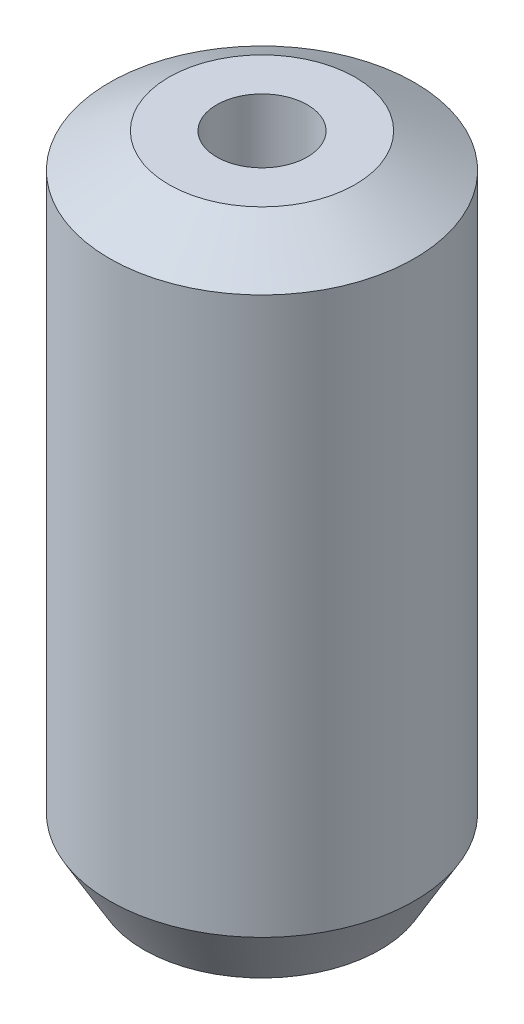
ISO-10303-21;
HEADER;
FILE_DESCRIPTION(('STEP AP214'),'2;1');
FILE_NAME('part.step','',(''),(''),'','','');
FILE_SCHEMA(('AUTOMOTIVE_DESIGN { 1 0 10303 214 1 1 1 1 }'));
ENDSEC;
DATA;
#1=APPLICATION_CONTEXT('core data for automotive mechanical design processes');
#2=APPLICATION_PROTOCOL_DEFINITION('international standard','automotive_design',2000,#1);
#3=PRODUCT_CONTEXT('',#1,'mechanical');
#4=PRODUCT('Part','Part','',(#3));
#5=PRODUCT_RELATED_PRODUCT_CATEGORY('part','',(#4));
#6=PRODUCT_DEFINITION_FORMATION('','',#4);
#7=PRODUCT_DEFINITION_CONTEXT('part definition',#1,'design');
#8=PRODUCT_DEFINITION('design','',#6,#7);
#9=PRODUCT_DEFINITION_SHAPE('','',#8);
#10=(LENGTH_UNIT() NAMED_UNIT(*) SI_UNIT(.MILLI.,.METRE.));
#11=(NAMED_UNIT(*) PLANE_ANGLE_UNIT() SI_UNIT($,.RADIAN.));
#12=(NAMED_UNIT(*) SI_UNIT($,.STERADIAN.) SOLID_ANGLE_UNIT());
#13=UNCERTAINTY_MEASURE_WITH_UNIT(LENGTH_MEASURE(1.E-05),#10,'distance_accuracy_value','');
#14=(GEOMETRIC_REPRESENTATION_CONTEXT(3) GLOBAL_UNCERTAINTY_ASSIGNED_CONTEXT((#13)) GLOBAL_UNIT_ASSIGNED_CONTEXT((#10,
#11,#12)) REPRESENTATION_CONTEXT('',''));
#15=CARTESIAN_POINT('',(0.,0.,0.));
#16=DIRECTION('',(0.,0.,1.));
#17=DIRECTION('',(1.,0.,0.));
#18=AXIS2_PLACEMENT_3D('',#15,#16,#17);
#19=CARTESIAN_POINT('',(0.,53.2852986697262,0.));
#20=DIRECTION('',(0.,-1.,0.));
#21=DIRECTION('',(0.,0.,-1.));
#22=AXIS2_PLACEMENT_3D('',#19,#20,#21);
#23=CYLINDRICAL_SURFACE('',#22,12.5);
#24=CARTESIAN_POINT('',(0.,50.4743077643252,0.));
#25=DIRECTION('',(0.,1.,0.));
#26=DIRECTION('',(0.,0.,1.));
#27=AXIS2_PLACEMENT_3D('',#24,#25,#26);
#28=CIRCLE('',#27,12.5);
#29=CARTESIAN_POINT('',(0.,50.4743077643252,-12.5));
#30=VERTEX_POINT('',#29);
#31=EDGE_CURVE('E50',#30,#30,#28,.F.);
#32=CARTESIAN_POINT('',(0.,4.86877906776862,0.));
#33=DIRECTION('',(0.,1.,0.));
#34=DIRECTION('',(0.,0.,1.));
#35=AXIS2_PLACEMENT_3D('',#32,#33,#34);
#36=CIRCLE('',#35,12.5);
#37=CARTESIAN_POINT('',(0.,4.86877906776862,-12.5));
#38=VERTEX_POINT('',#37);
#39=EDGE_CURVE('E51',#38,#38,#36,.T.);
#40=CARTESIAN_POINT('',(0.,50.4743077643252,-12.5));
#41=CARTESIAN_POINT('',(0.,49.9992501737361,-12.5));
#42=CARTESIAN_POINT('',(0.,49.524192583147,-12.5));
#43=CARTESIAN_POINT('',(0.,48.5740774019687,-12.5));
#44=CARTESIAN_POINT('',(0.,48.0990198113796,-12.5));
#45=CARTESIAN_POINT('',(0.,47.1489046302013,-12.5));
#46=CARTESIAN_POINT('',(0.,46.6738470396122,-12.5));
#47=CARTESIAN_POINT('',(0.,45.7237318584339,-12.5));
#48=CARTESIAN_POINT('',(0.,45.2486742678448,-12.5));
#49=CARTESIAN_POINT('',(0.,44.2985590866665,-12.5));
#50=CARTESIAN_POINT('',(0.,43.8235014960774,-12.5));
#51=CARTESIAN_POINT('',(0.,42.8733863148991,-12.5));
#52=CARTESIAN_POINT('',(0.,42.39832872431,-12.5));
#53=CARTESIAN_POINT('',(0.,41.4482135431317,-12.5));
#54=CARTESIAN_POINT('',(0.,40.9731559525426,-12.5));
#55=CARTESIAN_POINT('',(0.,40.0230407713643,-12.5));
#56=CARTESIAN_POINT('',(0.,39.5479831807752,-12.5));
#57=CARTESIAN_POINT('',(0.,38.5978679995969,-12.5));
#58=CARTESIAN_POINT('',(0.,38.1228104090078,-12.5));
#59=CARTESIAN_POINT('',(0.,37.1726952278295,-12.5));
#60=CARTESIAN_POINT('',(0.,36.6976376372404,-12.5));
#61=CARTESIAN_POINT('',(0.,35.7475224560622,-12.5));
#62=CARTESIAN_POINT('',(0.,35.272464865473,-12.5));
#63=CARTESIAN_POINT('',(0.,34.3223496842948,-12.5));
#64=CARTESIAN_POINT('',(0.,33.8472920937056,-12.5));
#65=CARTESIAN_POINT('',(0.,32.8971769125274,-12.5));
#66=CARTESIAN_POINT('',(0.,32.4221193219382,-12.5));
#67=CARTESIAN_POINT('',(0.,31.47200414076,-12.5));
#68=CARTESIAN_POINT('',(0.,30.9969465501708,-12.5));
#69=CARTESIAN_POINT('',(0.,30.0468313689926,-12.5));
#70=CARTESIAN_POINT('',(0.,29.5717737784034,-12.5));
#71=CARTESIAN_POINT('',(0.,28.6216585972252,-12.5));
#72=CARTESIAN_POINT('',(0.,28.1466010066361,-12.5));
#73=CARTESIAN_POINT('',(0.,27.1964858254578,-12.5));
#74=CARTESIAN_POINT('',(0.,26.7214282348687,-12.5));
#75=CARTESIAN_POINT('',(0.,25.7713130536904,-12.5));
#76=CARTESIAN_POINT('',(0.,25.2962554631013,-12.5));
#77=CARTESIAN_POINT('',(0.,24.346140281923,-12.5));
#78=CARTESIAN_POINT('',(0.,23.8710826913339,-12.5));
#79=CARTESIAN_POINT('',(0.,22.9209675101556,-12.5));
#80=CARTESIAN_POINT('',(0.,22.4459099195665,-12.5));
#81=CARTESIAN_POINT('',(0.,21.4957947383882,-12.5));
#82=CARTESIAN_POINT('',(0.,21.0207371477991,-12.5));
#83=CARTESIAN_POINT('',(0.,20.0706219666208,-12.5));
#84=CARTESIAN_POINT('',(0.,19.5955643760317,-12.5));
#85=CARTESIAN_POINT('',(0.,18.6454491948534,-12.5));
#86=CARTESIAN_POINT('',(0.,18.1703916042643,-12.5));
#87=CARTESIAN_POINT('',(0.,17.220276423086,-12.5));
#88=CARTESIAN_POINT('',(0.,16.7452188324969,-12.5));
#89=CARTESIAN_POINT('',(0.,15.7951036513186,-12.5));
#90=CARTESIAN_POINT('',(0.,15.3200460607295,-12.5));
#91=CARTESIAN_POINT('',(0.,14.3699308795512,-12.5));
#92=CARTESIAN_POINT('',(0.,13.8948732889621,-12.5));
#93=CARTESIAN_POINT('',(0.,12.9447581077839,-12.5));
#94=CARTESIAN_POINT('',(0.,12.4697005171947,-12.5));
#95=CARTESIAN_POINT('',(0.,11.5195853360165,-12.5));
#96=CARTESIAN_POINT('',(0.,11.0445277454273,-12.5));
#97=CARTESIAN_POINT('',(0.,10.0944125642491,-12.5));
#98=CARTESIAN_POINT('',(0.,9.61935497365993,-12.5));
#99=CARTESIAN_POINT('',(0.,8.66923979248167,-12.5));
#100=CARTESIAN_POINT('',(0.,8.19418220189254,-12.5));
#101=CARTESIAN_POINT('',(0.,7.24406702071428,-12.5));
#102=CARTESIAN_POINT('',(0.,6.76900943012515,-12.5));
#103=CARTESIAN_POINT('',(0.,5.81889424894688,-12.5));
#104=CARTESIAN_POINT('',(0.,5.34383665835775,-12.5));
#105=CARTESIAN_POINT('',(0.,4.86877906776862,-12.5));
#106=B_SPLINE_CURVE_WITH_KNOTS('',3,(#40,#41,#42,#43,#44,#45,#46,#47,#48,#49,#50,#51,#52,#53,
#54,#55,#56,#57,#58,#59,#60,#61,#62,#63,#64,#65,#66,#67,#68,#69,#70,#71,#72,#73,#74,#75,#76,#77,
#78,#79,#80,#81,#82,#83,#84,#85,#86,#87,#88,#89,#90,#91,#92,#93,#94,#95,#96,#97,#98,#99,#100,
#101,#102,#103,#104,#105),.UNSPECIFIED.,.F.,.F.,(4,2,2,2,2,2,2,2,2,2,2,2,2,2,2,2,2,2,2,2,2,2,2,
2,2,2,2,2,2,2,2,2,4),(0.,1.42517277176739,2.85034554353478,4.27551831530218,5.70069108706957,
7.12586385883696,8.55103663060436,9.97620940237175,11.4013821741391,12.8265549459065,
14.2517277176739,15.6769004894413,17.1020732612087,18.5272460329761,19.9524188047435,
21.3775915765109,22.8027643482783,24.2279371200457,25.6531098918131,27.0782826635805,
28.5034554353479,29.9286282071153,31.3538009788827,32.7789737506501,34.2041465224174,
35.6293192941848,37.0544920659522,38.4796648377196,39.904837609487,41.3300103812544,
42.7551831530218,44.1803559247892,45.6055286965566),.UNSPECIFIED.);
#107=EDGE_CURVE('BSEAM39',#30,#38,#106,.T.);
#108=ORIENTED_EDGE('',*,*,#31,.T.);
#109=ORIENTED_EDGE('',*,*,#39,.T.);
#110=ORIENTED_EDGE('',*,*,#107,.T.);
#111=ORIENTED_EDGE('',*,*,#107,.F.);
#112=EDGE_LOOP('',(#108,#110,#109,#111));
#113=FACE_BOUND('',#112,.T.);
#114=ADVANCED_FACE('F39',(#113),#23,.T.);
#115=CARTESIAN_POINT('',(0.,53.2852986697262,0.));
#116=DIRECTION('',(0.,1.,0.));
#117=DIRECTION('',(0.,0.,1.));
#118=AXIS2_PLACEMENT_3D('',#115,#116,#117);
#119=PLANE('',#118);
#120=CARTESIAN_POINT('',(0.,53.2852986697262,0.));
#121=DIRECTION('',(0.,1.,0.));
#122=DIRECTION('',(0.,0.,1.));
#123=AXIS2_PLACEMENT_3D('',#120,#121,#122);
#124=CIRCLE('',#123,7.6312209322315);
#125=CARTESIAN_POINT('',(0.,53.2852986697262,7.6312209322315));
#126=VERTEX_POINT('',#125);
#127=EDGE_CURVE('E54',#126,#126,#124,.T.);
#128=ORIENTED_EDGE('',*,*,#127,.T.);
#129=EDGE_LOOP('',(#128));
#130=FACE_BOUND('',#129,.T.);
#131=CARTESIAN_POINT('',(0.,53.2852986697262,0.));
#132=DIRECTION('',(0.,1.,0.));
#133=DIRECTION('',(0.,0.,1.));
#134=AXIS2_PLACEMENT_3D('',#131,#132,#133);
#135=CIRCLE('',#134,3.71471902201053);
#136=CARTESIAN_POINT('',(0.,53.2852986697262,-3.71471902201053));
#137=VERTEX_POINT('',#136);
#138=EDGE_CURVE('E58',#137,#137,#135,.T.);
#139=ORIENTED_EDGE('',*,*,#138,.F.);
#140=EDGE_LOOP('',(#139));
#141=FACE_BOUND('',#140,.T.);
#142=ADVANCED_FACE('F69',(#130,#141),#119,.T.);
#143=CARTESIAN_POINT('',(0.,0.,0.));
#144=DIRECTION('',(0.,1.,0.));
#145=DIRECTION('',(0.,0.,1.));
#146=AXIS2_PLACEMENT_3D('',#143,#144,#145);
#147=PLANE('',#146);
#148=CARTESIAN_POINT('',(0.,0.,0.));
#149=DIRECTION('',(0.,1.,0.));
#150=DIRECTION('',(0.,0.,1.));
#151=AXIS2_PLACEMENT_3D('',#148,#149,#150);
#152=CIRCLE('',#151,9.68900909459895);
#153=CARTESIAN_POINT('',(0.,0.,9.68900909459895));
#154=VERTEX_POINT('',#153);
#155=EDGE_CURVE('E10',#154,#154,#152,.F.);
#156=ORIENTED_EDGE('',*,*,#155,.T.);
#157=EDGE_LOOP('',(#156));
#158=FACE_BOUND('',#157,.T.);
#159=CARTESIAN_POINT('',(0.,0.,0.));
#160=DIRECTION('',(0.,1.,0.));
#161=DIRECTION('',(0.,0.,1.));
#162=AXIS2_PLACEMENT_3D('',#159,#160,#161);
#163=CIRCLE('',#162,3.71471902201053);
#164=CARTESIAN_POINT('',(0.,0.,-3.71471902201053));
#165=VERTEX_POINT('',#164);
#166=EDGE_CURVE('E63',#165,#165,#163,.T.);
#167=ORIENTED_EDGE('',*,*,#166,.T.);
#168=EDGE_LOOP('',(#167));
#169=FACE_BOUND('',#168,.T.);
#170=ADVANCED_FACE('F75',(#158,#169),#147,.F.);
#171=CARTESIAN_POINT('',(0.,53.2852986697262,0.));
#172=DIRECTION('',(0.,-1.,0.));
#173=DIRECTION('',(0.,0.,-1.));
#174=AXIS2_PLACEMENT_3D('',#171,#172,#173);
#175=CYLINDRICAL_SURFACE('',#174,3.71471902201053);
#176=CARTESIAN_POINT('',(0.,53.2852986697262,-3.71471902201053));
#177=CARTESIAN_POINT('',(0.,52.7302434752499,-3.71471902201053));
#178=CARTESIAN_POINT('',(0.,52.1751882807736,-3.71471902201053));
#179=CARTESIAN_POINT('',(0.,51.0650778918209,-3.71471902201053));
#180=CARTESIAN_POINT('',(0.,50.5100226973446,-3.71471902201053));
#181=CARTESIAN_POINT('',(0.,49.399912308392,-3.71471902201053));
#182=CARTESIAN_POINT('',(0.,48.8448571139157,-3.71471902201053));
#183=CARTESIAN_POINT('',(0.,47.7347467249631,-3.71471902201053));
#184=CARTESIAN_POINT('',(0.,47.1796915304867,-3.71471902201053));
#185=CARTESIAN_POINT('',(0.,46.0695811415341,-3.71471902201053));
#186=CARTESIAN_POINT('',(0.,45.5145259470578,-3.71471902201053));
#187=CARTESIAN_POINT('',(0.,44.4044155581052,-3.71471902201053));
#188=CARTESIAN_POINT('',(0.,43.8493603636288,-3.71471902201053));
#189=CARTESIAN_POINT('',(0.,42.7392499746762,-3.71471902201053));
#190=CARTESIAN_POINT('',(0.,42.1841947801999,-3.71471902201053));
#191=CARTESIAN_POINT('',(0.,41.0740843912473,-3.71471902201053));
#192=CARTESIAN_POINT('',(0.,40.519029196771,-3.71471902201053));
#193=CARTESIAN_POINT('',(0.,39.4089188078183,-3.71471902201053));
#194=CARTESIAN_POINT('',(0.,38.853863613342,-3.71471902201053));
#195=CARTESIAN_POINT('',(0.,37.7437532243894,-3.71471902201053));
#196=CARTESIAN_POINT('',(0.,37.1886980299131,-3.71471902201053));
#197=CARTESIAN_POINT('',(0.,36.0785876409604,-3.71471902201053));
#198=CARTESIAN_POINT('',(0.,35.5235324464841,-3.71471902201053));
#199=CARTESIAN_POINT('',(0.,34.4134220575315,-3.71471902201053));
#200=CARTESIAN_POINT('',(0.,33.8583668630552,-3.71471902201053));
#201=CARTESIAN_POINT('',(0.,32.7482564741026,-3.71471902201053));
#202=CARTESIAN_POINT('',(0.,32.1932012796262,-3.71471902201053));
#203=CARTESIAN_POINT('',(0.,31.0830908906736,-3.71471902201053));
#204=CARTESIAN_POINT('',(0.,30.5280356961973,-3.71471902201053));
#205=CARTESIAN_POINT('',(0.,29.4179253072447,-3.71471902201053));
#206=CARTESIAN_POINT('',(0.,28.8628701127684,-3.71471902201053));
#207=CARTESIAN_POINT('',(0.,27.7527597238157,-3.71471902201053));
#208=CARTESIAN_POINT('',(0.,27.1977045293394,-3.71471902201053));
#209=CARTESIAN_POINT('',(0.,26.0875941403868,-3.71471902201053));
#210=CARTESIAN_POINT('',(0.,25.5325389459105,-3.71471902201053));
#211=CARTESIAN_POINT('',(0.,24.4224285569578,-3.71471902201053));
#212=CARTESIAN_POINT('',(0.,23.8673733624815,-3.71471902201053));
#213=CARTESIAN_POINT('',(0.,22.7572629735289,-3.71471902201053));
#214=CARTESIAN_POINT('',(0.,22.2022077790526,-3.71471902201053));
#215=CARTESIAN_POINT('',(0.,21.0920973901,-3.71471902201053));
#216=CARTESIAN_POINT('',(0.,20.5370421956236,-3.71471902201053));
#217=CARTESIAN_POINT('',(0.,19.426931806671,-3.71471902201053));
#218=CARTESIAN_POINT('',(0.,18.8718766121947,-3.71471902201053));
#219=CARTESIAN_POINT('',(0.,17.7617662232421,-3.71471902201053));
#220=CARTESIAN_POINT('',(0.,17.2067110287657,-3.71471902201053));
#221=CARTESIAN_POINT('',(0.,16.0966006398131,-3.71471902201053));
#222=CARTESIAN_POINT('',(0.,15.5415454453368,-3.71471902201053));
#223=CARTESIAN_POINT('',(0.,14.4314350563842,-3.71471902201053));
#224=CARTESIAN_POINT('',(0.,13.8763798619079,-3.71471902201053));
#225=CARTESIAN_POINT('',(0.,12.7662694729552,-3.71471902201053));
#226=CARTESIAN_POINT('',(0.,12.2112142784789,-3.71471902201053));
#227=CARTESIAN_POINT('',(0.,11.1011038895263,-3.71471902201053));
#228=CARTESIAN_POINT('',(0.,10.54604869505,-3.71471902201053));
#229=CARTESIAN_POINT('',(0.,9.43593830609734,-3.71471902201053));
#230=CARTESIAN_POINT('',(0.,8.88088311162103,-3.71471902201053));
#231=CARTESIAN_POINT('',(0.,7.7707727226684,-3.71471902201053));
#232=CARTESIAN_POINT('',(0.,7.21571752819208,-3.71471902201053));
#233=CARTESIAN_POINT('',(0.,6.10560713923945,-3.71471902201053));
#234=CARTESIAN_POINT('',(0.,5.55055194476314,-3.71471902201053));
#235=CARTESIAN_POINT('',(0.,4.44044155581051,-3.71471902201053));
#236=CARTESIAN_POINT('',(0.,3.8853863613342,-3.71471902201053));
#237=CARTESIAN_POINT('',(0.,2.77527597238157,-3.71471902201053));
#238=CARTESIAN_POINT('',(0.,2.22022077790525,-3.71471902201053));
#239=CARTESIAN_POINT('',(0.,1.11011038895262,-3.71471902201053));
#240=CARTESIAN_POINT('',(0.,0.555055194476309,-3.71471902201053));
#241=CARTESIAN_POINT('',(0.,0.,-3.71471902201053));
#242=B_SPLINE_CURVE_WITH_KNOTS('',3,(#176,#177,#178,#179,#180,#181,#182,#183,#184,#185,#186,
#187,#188,#189,#190,#191,#192,#193,#194,#195,#196,#197,#198,#199,#200,#201,#202,#203,#204,#205,
#206,#207,#208,#209,#210,#211,#212,#213,#214,#215,#216,#217,#218,#219,#220,#221,#222,#223,#224,
#225,#226,#227,#228,#229,#230,#231,#232,#233,#234,#235,#236,#237,#238,#239,#240,#241),
.UNSPECIFIED.,.F.,.F.,(4,2,2,2,2,2,2,2,2,2,2,2,2,2,2,2,2,2,2,2,2,2,2,2,2,2,2,2,2,2,2,2,4),(0.,
1.66516558342895,3.33033116685789,4.99549675028683,6.66066233371578,8.32582791714472,
9.99099350057367,11.6561590840026,13.3213246674316,14.9864902508605,16.6516558342894,
18.3168214177184,19.9819870011473,21.6471525845763,23.3123181680052,24.9774837514342,
26.6426493348631,28.307814918292,29.972980501721,31.6381460851499,33.3033116685789,
34.9684772520078,36.6336428354368,38.2988084188657,39.9639740022947,41.6291395857236,
43.2943051691525,44.9594707525815,46.6246363360104,48.2898019194394,49.9549675028683,
51.6201330862973,53.2852986697262),.UNSPECIFIED.);
#243=EDGE_CURVE('BSEAM70',#137,#165,#242,.T.);
#244=ORIENTED_EDGE('',*,*,#138,.T.);
#245=ORIENTED_EDGE('',*,*,#166,.F.);
#246=ORIENTED_EDGE('',*,*,#243,.T.);
#247=ORIENTED_EDGE('',*,*,#243,.F.);
#248=EDGE_LOOP('',(#244,#246,#245,#247));
#249=FACE_BOUND('',#248,.T.);
#250=ADVANCED_FACE('F70',(#249),#175,.F.);
#251=CARTESIAN_POINT('',(0.,53.2852986697262,0.));
#252=DIRECTION('',(0.,-1.,0.));
#253=DIRECTION('',(0.,0.,-1.));
#254=AXIS2_PLACEMENT_3D('',#251,#252,#253);
#255=CONICAL_SURFACE('',#254,7.6312209322315,1.0471975511966);
#256=ORIENTED_EDGE('',*,*,#31,.F.);
#257=EDGE_LOOP('',(#256));
#258=FACE_BOUND('',#257,.T.);
#259=ORIENTED_EDGE('',*,*,#127,.F.);
#260=EDGE_LOOP('',(#259));
#261=FACE_BOUND('',#260,.T.);
#262=ADVANCED_FACE('F81',(#258,#261),#255,.T.);
#263=CARTESIAN_POINT('',(0.,4.86877906776862,0.));
#264=DIRECTION('',(0.,1.,0.));
#265=DIRECTION('',(0.,0.,1.));
#266=AXIS2_PLACEMENT_3D('',#263,#264,#265);
#267=CONICAL_SURFACE('',#266,12.5,0.523598775598302);
#268=ORIENTED_EDGE('',*,*,#155,.F.);
#269=EDGE_LOOP('',(#268));
#270=FACE_BOUND('',#269,.T.);
#271=ORIENTED_EDGE('',*,*,#39,.F.);
#272=EDGE_LOOP('',(#271));
#273=FACE_BOUND('',#272,.T.);
#274=ADVANCED_FACE('F45',(#270,#273),#267,.T.);
#275=CLOSED_SHELL('',(#114,#142,#170,#250,#262,#274));
#276=MANIFOLD_SOLID_BREP('B2',#275);
#277=ADVANCED_BREP_SHAPE_REPRESENTATION('',(#18,#276),#14);
#278=SHAPE_DEFINITION_REPRESENTATION(#9,#277);
ENDSEC;
END-ISO-10303-21;
